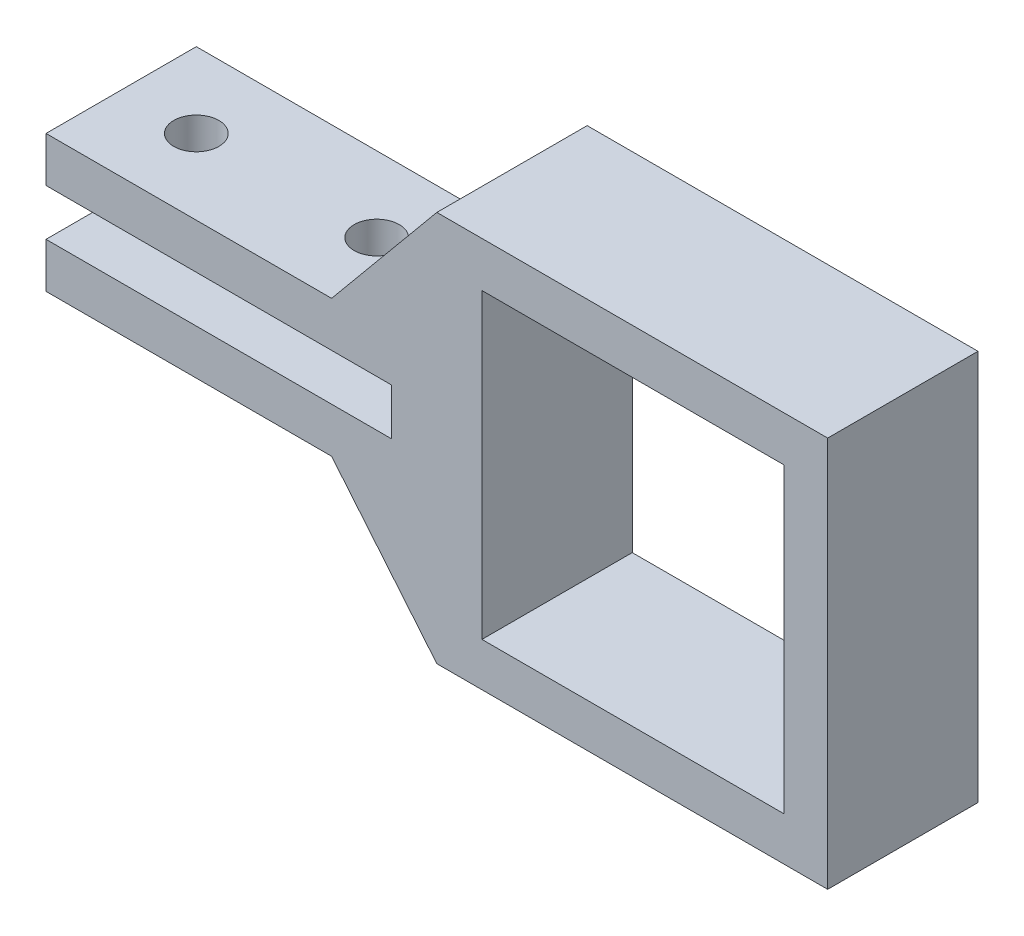
ISO-10303-21;
HEADER;
FILE_DESCRIPTION(('STEP AP214'),'2;1');
FILE_NAME('part.step','',(''),(''),'','','');
FILE_SCHEMA(('AUTOMOTIVE_DESIGN { 1 0 10303 214 1 1 1 1 }'));
ENDSEC;
DATA;
#1=APPLICATION_CONTEXT('core data for automotive mechanical design processes');
#2=APPLICATION_PROTOCOL_DEFINITION('international standard','automotive_design',2000,#1);
#3=PRODUCT_CONTEXT('',#1,'mechanical');
#4=PRODUCT('Part','Part','',(#3));
#5=PRODUCT_RELATED_PRODUCT_CATEGORY('part','',(#4));
#6=PRODUCT_DEFINITION_FORMATION('','',#4);
#7=PRODUCT_DEFINITION_CONTEXT('part definition',#1,'design');
#8=PRODUCT_DEFINITION('design','',#6,#7);
#9=PRODUCT_DEFINITION_SHAPE('','',#8);
#10=(LENGTH_UNIT() NAMED_UNIT(*) SI_UNIT(.MILLI.,.METRE.));
#11=(NAMED_UNIT(*) PLANE_ANGLE_UNIT() SI_UNIT($,.RADIAN.));
#12=(NAMED_UNIT(*) SI_UNIT($,.STERADIAN.) SOLID_ANGLE_UNIT());
#13=UNCERTAINTY_MEASURE_WITH_UNIT(LENGTH_MEASURE(1.E-05),#10,'distance_accuracy_value','');
#14=(GEOMETRIC_REPRESENTATION_CONTEXT(3) GLOBAL_UNCERTAINTY_ASSIGNED_CONTEXT((#13)) GLOBAL_UNIT_ASSIGNED_CONTEXT((#10,
#11,#12)) REPRESENTATION_CONTEXT('',''));
#15=CARTESIAN_POINT('',(0.,0.,0.));
#16=DIRECTION('',(0.,0.,1.));
#17=DIRECTION('',(1.,0.,0.));
#18=AXIS2_PLACEMENT_3D('',#15,#16,#17);
#19=CARTESIAN_POINT('',(0.,-13.,10.));
#20=DIRECTION('',(-0.770085518726512,-0.637940666400661,0.));
#21=DIRECTION('',(0.637940666400661,-0.770085518726512,0.));
#22=AXIS2_PLACEMENT_3D('',#19,#20,#21);
#23=PLANE('',#22);
#24=DIRECTION('',(-0.637940666400661,0.770085518726512,0.));
#25=VECTOR('',#24,1.);
#26=CARTESIAN_POINT('',(0.,-13.,0.));
#27=LINE('',#26,#25);
#28=CARTESIAN_POINT('',(0.,-13.,0.));
#29=VERTEX_POINT('',#28);
#30=CARTESIAN_POINT('',(-7.,-4.55,0.));
#31=VERTEX_POINT('',#30);
#32=EDGE_CURVE('E173',#29,#31,#27,.T.);
#33=ORIENTED_EDGE('',*,*,#32,.F.);
#34=DIRECTION('',(0.,0.,-1.));
#35=VECTOR('',#34,1.);
#36=CARTESIAN_POINT('',(0.,-13.,10.));
#37=LINE('',#36,#35);
#38=CARTESIAN_POINT('',(0.,-13.,10.));
#39=VERTEX_POINT('',#38);
#40=EDGE_CURVE('E240',#39,#29,#37,.T.);
#41=ORIENTED_EDGE('',*,*,#40,.F.);
#42=DIRECTION('',(-0.637940666400661,0.770085518726512,0.));
#43=VECTOR('',#42,1.);
#44=CARTESIAN_POINT('',(0.,-13.,10.));
#45=LINE('',#44,#43);
#46=CARTESIAN_POINT('',(-7.,-4.55,10.));
#47=VERTEX_POINT('',#46);
#48=EDGE_CURVE('E176',#39,#47,#45,.T.);
#49=ORIENTED_EDGE('',*,*,#48,.T.);
#50=DIRECTION('',(0.,0.,-1.));
#51=VECTOR('',#50,1.);
#52=CARTESIAN_POINT('',(-7.,-4.55,10.));
#53=LINE('',#52,#51);
#54=EDGE_CURVE('E207',#47,#31,#53,.T.);
#55=ORIENTED_EDGE('',*,*,#54,.T.);
#56=EDGE_LOOP('',(#33,#41,#49,#55));
#57=FACE_BOUND('',#56,.T.);
#58=ADVANCED_FACE('F35',(#57),#23,.T.);
#59=CARTESIAN_POINT('',(0.,-13.,10.));
#60=DIRECTION('',(0.,1.,0.));
#61=DIRECTION('',(-1.,0.,0.));
#62=AXIS2_PLACEMENT_3D('',#59,#60,#61);
#63=PLANE('',#62);
#64=DIRECTION('',(1.,0.,0.));
#65=VECTOR('',#64,1.);
#66=CARTESIAN_POINT('',(0.,-13.,0.));
#67=LINE('',#66,#65);
#68=CARTESIAN_POINT('',(26.,-13.,0.));
#69=VERTEX_POINT('',#68);
#70=EDGE_CURVE('E180',#29,#69,#67,.T.);
#71=ORIENTED_EDGE('',*,*,#70,.T.);
#72=DIRECTION('',(0.,0.,-1.));
#73=VECTOR('',#72,1.);
#74=CARTESIAN_POINT('',(26.,-13.,10.));
#75=LINE('',#74,#73);
#76=CARTESIAN_POINT('',(26.,-13.,10.));
#77=VERTEX_POINT('',#76);
#78=EDGE_CURVE('E243',#77,#69,#75,.T.);
#79=ORIENTED_EDGE('',*,*,#78,.F.);
#80=DIRECTION('',(1.,0.,0.));
#81=VECTOR('',#80,1.);
#82=CARTESIAN_POINT('',(0.,-13.,10.));
#83=LINE('',#82,#81);
#84=EDGE_CURVE('E205',#39,#77,#83,.T.);
#85=ORIENTED_EDGE('',*,*,#84,.F.);
#86=ORIENTED_EDGE('',*,*,#40,.T.);
#87=EDGE_LOOP('',(#71,#79,#85,#86));
#88=FACE_BOUND('',#87,.T.);
#89=ADVANCED_FACE('F286',(#88),#63,.F.);
#90=CARTESIAN_POINT('',(26.,13.,10.));
#91=DIRECTION('',(1.,0.,0.));
#92=DIRECTION('',(0.,0.,-1.));
#93=AXIS2_PLACEMENT_3D('',#90,#91,#92);
#94=PLANE('',#93);
#95=DIRECTION('',(0.,-1.,0.));
#96=VECTOR('',#95,1.);
#97=CARTESIAN_POINT('',(26.,13.,0.));
#98=LINE('',#97,#96);
#99=CARTESIAN_POINT('',(26.,13.,0.));
#100=VERTEX_POINT('',#99);
#101=EDGE_CURVE('E235',#100,#69,#98,.T.);
#102=ORIENTED_EDGE('',*,*,#101,.F.);
#103=DIRECTION('',(0.,0.,-1.));
#104=VECTOR('',#103,1.);
#105=CARTESIAN_POINT('',(26.,13.,10.));
#106=LINE('',#105,#104);
#107=CARTESIAN_POINT('',(26.,13.,10.));
#108=VERTEX_POINT('',#107);
#109=EDGE_CURVE('E245',#108,#100,#106,.T.);
#110=ORIENTED_EDGE('',*,*,#109,.F.);
#111=DIRECTION('',(0.,-1.,0.));
#112=VECTOR('',#111,1.);
#113=CARTESIAN_POINT('',(26.,13.,10.));
#114=LINE('',#113,#112);
#115=EDGE_CURVE('E202',#108,#77,#114,.T.);
#116=ORIENTED_EDGE('',*,*,#115,.T.);
#117=ORIENTED_EDGE('',*,*,#78,.T.);
#118=EDGE_LOOP('',(#102,#110,#116,#117));
#119=FACE_BOUND('',#118,.T.);
#120=ADVANCED_FACE('F291',(#119),#94,.T.);
#121=CARTESIAN_POINT('',(0.,13.,10.));
#122=DIRECTION('',(0.,1.,0.));
#123=DIRECTION('',(-1.,0.,0.));
#124=AXIS2_PLACEMENT_3D('',#121,#122,#123);
#125=PLANE('',#124);
#126=DIRECTION('',(1.,0.,0.));
#127=VECTOR('',#126,1.);
#128=CARTESIAN_POINT('',(0.,13.,0.));
#129=LINE('',#128,#127);
#130=CARTESIAN_POINT('',(0.,13.,0.));
#131=VERTEX_POINT('',#130);
#132=EDGE_CURVE('E232',#131,#100,#129,.T.);
#133=ORIENTED_EDGE('',*,*,#132,.F.);
#134=DIRECTION('',(0.,0.,-1.));
#135=VECTOR('',#134,1.);
#136=CARTESIAN_POINT('',(0.,13.,10.));
#137=LINE('',#136,#135);
#138=CARTESIAN_POINT('',(0.,13.,10.));
#139=VERTEX_POINT('',#138);
#140=EDGE_CURVE('E247',#139,#131,#137,.T.);
#141=ORIENTED_EDGE('',*,*,#140,.F.);
#142=DIRECTION('',(1.,0.,0.));
#143=VECTOR('',#142,1.);
#144=CARTESIAN_POINT('',(0.,13.,10.));
#145=LINE('',#144,#143);
#146=EDGE_CURVE('E199',#139,#108,#145,.T.);
#147=ORIENTED_EDGE('',*,*,#146,.T.);
#148=ORIENTED_EDGE('',*,*,#109,.T.);
#149=EDGE_LOOP('',(#133,#141,#147,#148));
#150=FACE_BOUND('',#149,.T.);
#151=ADVANCED_FACE('F339',(#150),#125,.T.);
#152=CARTESIAN_POINT('',(0.,13.,10.));
#153=DIRECTION('',(0.770085518726512,-0.637940666400661,0.));
#154=DIRECTION('',(0.637940666400661,0.770085518726512,0.));
#155=AXIS2_PLACEMENT_3D('',#152,#153,#154);
#156=PLANE('',#155);
#157=DIRECTION('',(-0.637940666400661,-0.770085518726512,0.));
#158=VECTOR('',#157,1.);
#159=CARTESIAN_POINT('',(0.,13.,0.));
#160=LINE('',#159,#158);
#161=CARTESIAN_POINT('',(-7.,4.55,0.));
#162=VERTEX_POINT('',#161);
#163=EDGE_CURVE('E229',#131,#162,#160,.T.);
#164=ORIENTED_EDGE('',*,*,#163,.T.);
#165=DIRECTION('',(0.,0.,-1.));
#166=VECTOR('',#165,1.);
#167=CARTESIAN_POINT('',(-7.,4.55,10.));
#168=LINE('',#167,#166);
#169=CARTESIAN_POINT('',(-7.,4.55,10.));
#170=VERTEX_POINT('',#169);
#171=EDGE_CURVE('E249',#170,#162,#168,.T.);
#172=ORIENTED_EDGE('',*,*,#171,.F.);
#173=DIRECTION('',(-0.637940666400661,-0.770085518726512,0.));
#174=VECTOR('',#173,1.);
#175=CARTESIAN_POINT('',(0.,13.,10.));
#176=LINE('',#175,#174);
#177=EDGE_CURVE('E197',#139,#170,#176,.T.);
#178=ORIENTED_EDGE('',*,*,#177,.F.);
#179=ORIENTED_EDGE('',*,*,#140,.T.);
#180=EDGE_LOOP('',(#164,#172,#178,#179));
#181=FACE_BOUND('',#180,.T.);
#182=ADVANCED_FACE('F336',(#181),#156,.F.);
#183=CARTESIAN_POINT('',(-26.,4.55,10.));
#184=DIRECTION('',(0.,1.,0.));
#185=DIRECTION('',(0.,0.,1.));
#186=AXIS2_PLACEMENT_3D('',#183,#184,#185);
#187=PLANE('',#186);
#188=CARTESIAN_POINT('',(-21.,4.55,5.));
#189=DIRECTION('',(0.,1.,0.));
#190=DIRECTION('',(-1.,0.,0.));
#191=AXIS2_PLACEMENT_3D('',#188,#189,#190);
#192=CIRCLE('',#191,1.5);
#193=CARTESIAN_POINT('',(-22.5,4.55,5.));
#194=VERTEX_POINT('',#193);
#195=EDGE_CURVE('E374',#194,#194,#192,.T.);
#196=ORIENTED_EDGE('',*,*,#195,.F.);
#197=EDGE_LOOP('',(#196));
#198=FACE_BOUND('',#197,.T.);
#199=CARTESIAN_POINT('',(-9.,4.55,5.));
#200=DIRECTION('',(0.,1.,0.));
#201=DIRECTION('',(-1.,0.,0.));
#202=AXIS2_PLACEMENT_3D('',#199,#200,#201);
#203=CIRCLE('',#202,1.5);
#204=CARTESIAN_POINT('',(-10.5,4.55,5.));
#205=VERTEX_POINT('',#204);
#206=EDGE_CURVE('E375',#205,#205,#203,.T.);
#207=ORIENTED_EDGE('',*,*,#206,.F.);
#208=EDGE_LOOP('',(#207));
#209=FACE_BOUND('',#208,.T.);
#210=DIRECTION('',(1.,0.,0.));
#211=VECTOR('',#210,1.);
#212=CARTESIAN_POINT('',(-26.,4.55,0.));
#213=LINE('',#212,#211);
#214=CARTESIAN_POINT('',(-26.,4.55,0.));
#215=VERTEX_POINT('',#214);
#216=EDGE_CURVE('E226',#215,#162,#213,.T.);
#217=ORIENTED_EDGE('',*,*,#216,.F.);
#218=DIRECTION('',(0.,0.,-1.));
#219=VECTOR('',#218,1.);
#220=CARTESIAN_POINT('',(-26.,4.55,10.));
#221=LINE('',#220,#219);
#222=CARTESIAN_POINT('',(-26.,4.55,10.));
#223=VERTEX_POINT('',#222);
#224=EDGE_CURVE('E251',#223,#215,#221,.T.);
#225=ORIENTED_EDGE('',*,*,#224,.F.);
#226=DIRECTION('',(1.,0.,0.));
#227=VECTOR('',#226,1.);
#228=CARTESIAN_POINT('',(-26.,4.55,10.));
#229=LINE('',#228,#227);
#230=EDGE_CURVE('E194',#223,#170,#229,.T.);
#231=ORIENTED_EDGE('',*,*,#230,.T.);
#232=ORIENTED_EDGE('',*,*,#171,.T.);
#233=EDGE_LOOP('',(#217,#225,#231,#232));
#234=FACE_BOUND('',#233,.T.);
#235=ADVANCED_FACE('F330',(#198,#209,#234),#187,.T.);
#236=CARTESIAN_POINT('',(-26.,4.55,10.));
#237=DIRECTION('',(1.,0.,0.));
#238=DIRECTION('',(0.,0.,-1.));
#239=AXIS2_PLACEMENT_3D('',#236,#237,#238);
#240=PLANE('',#239);
#241=DIRECTION('',(0.,-1.,0.));
#242=VECTOR('',#241,1.);
#243=CARTESIAN_POINT('',(-26.,4.55,0.));
#244=LINE('',#243,#242);
#245=CARTESIAN_POINT('',(-26.,1.55,0.));
#246=VERTEX_POINT('',#245);
#247=EDGE_CURVE('E224',#215,#246,#244,.T.);
#248=ORIENTED_EDGE('',*,*,#247,.T.);
#249=DIRECTION('',(0.,0.,-1.));
#250=VECTOR('',#249,1.);
#251=CARTESIAN_POINT('',(-26.,1.55,10.));
#252=LINE('',#251,#250);
#253=CARTESIAN_POINT('',(-26.,1.55,10.));
#254=VERTEX_POINT('',#253);
#255=EDGE_CURVE('E253',#254,#246,#252,.T.);
#256=ORIENTED_EDGE('',*,*,#255,.F.);
#257=DIRECTION('',(0.,-1.,0.));
#258=VECTOR('',#257,1.);
#259=CARTESIAN_POINT('',(-26.,4.55,10.));
#260=LINE('',#259,#258);
#261=EDGE_CURVE('E192',#223,#254,#260,.T.);
#262=ORIENTED_EDGE('',*,*,#261,.F.);
#263=ORIENTED_EDGE('',*,*,#224,.T.);
#264=EDGE_LOOP('',(#248,#256,#262,#263));
#265=FACE_BOUND('',#264,.T.);
#266=ADVANCED_FACE('F342',(#265),#240,.F.);
#267=CARTESIAN_POINT('',(-26.,1.55,10.));
#268=DIRECTION('',(0.,1.,0.));
#269=DIRECTION('',(0.,0.,1.));
#270=AXIS2_PLACEMENT_3D('',#267,#268,#269);
#271=PLANE('',#270);
#272=CARTESIAN_POINT('',(-21.,1.55,5.));
#273=DIRECTION('',(0.,1.,0.));
#274=DIRECTION('',(0.,0.,1.));
#275=AXIS2_PLACEMENT_3D('',#272,#273,#274);
#276=CIRCLE('',#275,1.5);
#277=CARTESIAN_POINT('',(-21.,1.55,6.5));
#278=VERTEX_POINT('',#277);
#279=EDGE_CURVE('E392',#278,#278,#276,.T.);
#280=ORIENTED_EDGE('',*,*,#279,.T.);
#281=EDGE_LOOP('',(#280));
#282=FACE_BOUND('',#281,.T.);
#283=CARTESIAN_POINT('',(-9.,1.55,5.));
#284=DIRECTION('',(0.,1.,0.));
#285=DIRECTION('',(0.,0.,1.));
#286=AXIS2_PLACEMENT_3D('',#283,#284,#285);
#287=CIRCLE('',#286,1.5);
#288=CARTESIAN_POINT('',(-9.,1.55,6.5));
#289=VERTEX_POINT('',#288);
#290=EDGE_CURVE('E386',#289,#289,#287,.T.);
#291=ORIENTED_EDGE('',*,*,#290,.T.);
#292=EDGE_LOOP('',(#291));
#293=FACE_BOUND('',#292,.T.);
#294=DIRECTION('',(1.,0.,0.));
#295=VECTOR('',#294,1.);
#296=CARTESIAN_POINT('',(-26.,1.55,0.));
#297=LINE('',#296,#295);
#298=CARTESIAN_POINT('',(-3.,1.55,0.));
#299=VERTEX_POINT('',#298);
#300=EDGE_CURVE('E222',#246,#299,#297,.T.);
#301=ORIENTED_EDGE('',*,*,#300,.T.);
#302=DIRECTION('',(0.,0.,-1.));
#303=VECTOR('',#302,1.);
#304=CARTESIAN_POINT('',(-3.,1.55,10.));
#305=LINE('',#304,#303);
#306=CARTESIAN_POINT('',(-3.,1.55,10.));
#307=VERTEX_POINT('',#306);
#308=EDGE_CURVE('E256',#307,#299,#305,.T.);
#309=ORIENTED_EDGE('',*,*,#308,.F.);
#310=DIRECTION('',(1.,0.,0.));
#311=VECTOR('',#310,1.);
#312=CARTESIAN_POINT('',(-26.,1.55,10.));
#313=LINE('',#312,#311);
#314=EDGE_CURVE('E190',#254,#307,#313,.T.);
#315=ORIENTED_EDGE('',*,*,#314,.F.);
#316=ORIENTED_EDGE('',*,*,#255,.T.);
#317=EDGE_LOOP('',(#301,#309,#315,#316));
#318=FACE_BOUND('',#317,.T.);
#319=ADVANCED_FACE('F323',(#282,#293,#318),#271,.F.);
#320=CARTESIAN_POINT('',(-3.,1.55,10.));
#321=DIRECTION('',(1.,0.,0.));
#322=DIRECTION('',(0.,0.,-1.));
#323=AXIS2_PLACEMENT_3D('',#320,#321,#322);
#324=PLANE('',#323);
#325=DIRECTION('',(0.,-1.,0.));
#326=VECTOR('',#325,1.);
#327=CARTESIAN_POINT('',(-3.,1.55,0.));
#328=LINE('',#327,#326);
#329=CARTESIAN_POINT('',(-3.,-1.55,0.));
#330=VERTEX_POINT('',#329);
#331=EDGE_CURVE('E219',#299,#330,#328,.T.);
#332=ORIENTED_EDGE('',*,*,#331,.T.);
#333=DIRECTION('',(0.,0.,-1.));
#334=VECTOR('',#333,1.);
#335=CARTESIAN_POINT('',(-3.,-1.55,10.));
#336=LINE('',#335,#334);
#337=CARTESIAN_POINT('',(-3.,-1.55,10.));
#338=VERTEX_POINT('',#337);
#339=EDGE_CURVE('E259',#338,#330,#336,.T.);
#340=ORIENTED_EDGE('',*,*,#339,.F.);
#341=DIRECTION('',(0.,-1.,0.));
#342=VECTOR('',#341,1.);
#343=CARTESIAN_POINT('',(-3.,1.55,10.));
#344=LINE('',#343,#342);
#345=EDGE_CURVE('E188',#307,#338,#344,.T.);
#346=ORIENTED_EDGE('',*,*,#345,.F.);
#347=ORIENTED_EDGE('',*,*,#308,.T.);
#348=EDGE_LOOP('',(#332,#340,#346,#347));
#349=FACE_BOUND('',#348,.T.);
#350=ADVANCED_FACE('F319',(#349),#324,.F.);
#351=CARTESIAN_POINT('',(-26.,-1.55,10.));
#352=DIRECTION('',(0.,1.,0.));
#353=DIRECTION('',(0.,0.,1.));
#354=AXIS2_PLACEMENT_3D('',#351,#352,#353);
#355=PLANE('',#354);
#356=CARTESIAN_POINT('',(-21.,-1.55,5.));
#357=DIRECTION('',(0.,1.,0.));
#358=DIRECTION('',(0.,0.,1.));
#359=AXIS2_PLACEMENT_3D('',#356,#357,#358);
#360=CIRCLE('',#359,1.5);
#361=CARTESIAN_POINT('',(-21.,-1.55,6.5));
#362=VERTEX_POINT('',#361);
#363=EDGE_CURVE('E389',#362,#362,#360,.T.);
#364=ORIENTED_EDGE('',*,*,#363,.F.);
#365=EDGE_LOOP('',(#364));
#366=FACE_BOUND('',#365,.T.);
#367=CARTESIAN_POINT('',(-9.,-1.55,5.));
#368=DIRECTION('',(0.,1.,0.));
#369=DIRECTION('',(0.,0.,1.));
#370=AXIS2_PLACEMENT_3D('',#367,#368,#369);
#371=CIRCLE('',#370,1.5);
#372=CARTESIAN_POINT('',(-9.,-1.55,6.5));
#373=VERTEX_POINT('',#372);
#374=EDGE_CURVE('E383',#373,#373,#371,.T.);
#375=ORIENTED_EDGE('',*,*,#374,.F.);
#376=EDGE_LOOP('',(#375));
#377=FACE_BOUND('',#376,.T.);
#378=DIRECTION('',(1.,0.,0.));
#379=VECTOR('',#378,1.);
#380=CARTESIAN_POINT('',(-26.,-1.55,0.));
#381=LINE('',#380,#379);
#382=CARTESIAN_POINT('',(-26.,-1.55,0.));
#383=VERTEX_POINT('',#382);
#384=EDGE_CURVE('E216',#383,#330,#381,.T.);
#385=ORIENTED_EDGE('',*,*,#384,.F.);
#386=DIRECTION('',(0.,0.,-1.));
#387=VECTOR('',#386,1.);
#388=CARTESIAN_POINT('',(-26.,-1.55,10.));
#389=LINE('',#388,#387);
#390=CARTESIAN_POINT('',(-26.,-1.55,10.));
#391=VERTEX_POINT('',#390);
#392=EDGE_CURVE('E261',#391,#383,#389,.T.);
#393=ORIENTED_EDGE('',*,*,#392,.F.);
#394=DIRECTION('',(1.,0.,0.));
#395=VECTOR('',#394,1.);
#396=CARTESIAN_POINT('',(-26.,-1.55,10.));
#397=LINE('',#396,#395);
#398=EDGE_CURVE('E185',#391,#338,#397,.T.);
#399=ORIENTED_EDGE('',*,*,#398,.T.);
#400=ORIENTED_EDGE('',*,*,#339,.T.);
#401=EDGE_LOOP('',(#385,#393,#399,#400));
#402=FACE_BOUND('',#401,.T.);
#403=ADVANCED_FACE('F315',(#366,#377,#402),#355,.T.);
#404=CARTESIAN_POINT('',(-26.,-4.55,10.));
#405=DIRECTION('',(-1.,0.,0.));
#406=DIRECTION('',(0.,0.,1.));
#407=AXIS2_PLACEMENT_3D('',#404,#405,#406);
#408=PLANE('',#407);
#409=DIRECTION('',(0.,1.,0.));
#410=VECTOR('',#409,1.);
#411=CARTESIAN_POINT('',(-26.,-4.55,0.));
#412=LINE('',#411,#410);
#413=CARTESIAN_POINT('',(-26.,-4.55,0.));
#414=VERTEX_POINT('',#413);
#415=EDGE_CURVE('E213',#414,#383,#412,.T.);
#416=ORIENTED_EDGE('',*,*,#415,.F.);
#417=DIRECTION('',(0.,0.,-1.));
#418=VECTOR('',#417,1.);
#419=CARTESIAN_POINT('',(-26.,-4.55,10.));
#420=LINE('',#419,#418);
#421=CARTESIAN_POINT('',(-26.,-4.55,10.));
#422=VERTEX_POINT('',#421);
#423=EDGE_CURVE('E263',#422,#414,#420,.T.);
#424=ORIENTED_EDGE('',*,*,#423,.F.);
#425=DIRECTION('',(0.,1.,0.));
#426=VECTOR('',#425,1.);
#427=CARTESIAN_POINT('',(-26.,-4.55,10.));
#428=LINE('',#427,#426);
#429=EDGE_CURVE('E182',#422,#391,#428,.T.);
#430=ORIENTED_EDGE('',*,*,#429,.T.);
#431=ORIENTED_EDGE('',*,*,#392,.T.);
#432=EDGE_LOOP('',(#416,#424,#430,#431));
#433=FACE_BOUND('',#432,.T.);
#434=ADVANCED_FACE('F310',(#433),#408,.T.);
#435=CARTESIAN_POINT('',(-26.,-4.55,10.));
#436=DIRECTION('',(0.,1.,0.));
#437=DIRECTION('',(0.,0.,1.));
#438=AXIS2_PLACEMENT_3D('',#435,#436,#437);
#439=PLANE('',#438);
#440=CARTESIAN_POINT('',(-21.,-4.55,5.));
#441=DIRECTION('',(0.,1.,0.));
#442=DIRECTION('',(0.,0.,1.));
#443=AXIS2_PLACEMENT_3D('',#440,#441,#442);
#444=CIRCLE('',#443,1.5);
#445=CARTESIAN_POINT('',(-21.,-4.55,6.5));
#446=VERTEX_POINT('',#445);
#447=EDGE_CURVE('E369',#446,#446,#444,.F.);
#448=ORIENTED_EDGE('',*,*,#447,.F.);
#449=EDGE_LOOP('',(#448));
#450=FACE_BOUND('',#449,.T.);
#451=CARTESIAN_POINT('',(-9.,-4.55,5.));
#452=DIRECTION('',(0.,1.,0.));
#453=DIRECTION('',(0.,0.,1.));
#454=AXIS2_PLACEMENT_3D('',#451,#452,#453);
#455=CIRCLE('',#454,1.5);
#456=CARTESIAN_POINT('',(-9.,-4.55,6.5));
#457=VERTEX_POINT('',#456);
#458=EDGE_CURVE('E372',#457,#457,#455,.F.);
#459=ORIENTED_EDGE('',*,*,#458,.F.);
#460=EDGE_LOOP('',(#459));
#461=FACE_BOUND('',#460,.T.);
#462=DIRECTION('',(1.,0.,0.));
#463=VECTOR('',#462,1.);
#464=CARTESIAN_POINT('',(-26.,-4.55,0.));
#465=LINE('',#464,#463);
#466=EDGE_CURVE('E210',#414,#31,#465,.T.);
#467=ORIENTED_EDGE('',*,*,#466,.T.);
#468=ORIENTED_EDGE('',*,*,#54,.F.);
#469=DIRECTION('',(1.,0.,0.));
#470=VECTOR('',#469,1.);
#471=CARTESIAN_POINT('',(-26.,-4.55,10.));
#472=LINE('',#471,#470);
#473=EDGE_CURVE('E179',#422,#47,#472,.T.);
#474=ORIENTED_EDGE('',*,*,#473,.F.);
#475=ORIENTED_EDGE('',*,*,#423,.T.);
#476=EDGE_LOOP('',(#467,#468,#474,#475));
#477=FACE_BOUND('',#476,.T.);
#478=ADVANCED_FACE('F308',(#450,#461,#477),#439,.F.);
#479=CARTESIAN_POINT('',(0.,0.,10.));
#480=DIRECTION('',(0.,0.,1.));
#481=DIRECTION('',(1.,0.,0.));
#482=AXIS2_PLACEMENT_3D('',#479,#480,#481);
#483=PLANE('',#482);
#484=DIRECTION('',(-1.,0.,0.));
#485=VECTOR('',#484,1.);
#486=CARTESIAN_POINT('',(23.1,10.,10.));
#487=LINE('',#486,#485);
#488=CARTESIAN_POINT('',(23.1,10.,10.));
#489=VERTEX_POINT('',#488);
#490=CARTESIAN_POINT('',(3.,10.,10.));
#491=VERTEX_POINT('',#490);
#492=EDGE_CURVE('E49',#489,#491,#487,.T.);
#493=ORIENTED_EDGE('',*,*,#492,.F.);
#494=DIRECTION('',(0.,1.,0.));
#495=VECTOR('',#494,1.);
#496=CARTESIAN_POINT('',(23.1,10.,10.));
#497=LINE('',#496,#495);
#498=CARTESIAN_POINT('',(23.1,-10.1,10.));
#499=VERTEX_POINT('',#498);
#500=EDGE_CURVE('E166',#499,#489,#497,.T.);
#501=ORIENTED_EDGE('',*,*,#500,.F.);
#502=DIRECTION('',(1.,0.,0.));
#503=VECTOR('',#502,1.);
#504=CARTESIAN_POINT('',(3.,-10.1,10.));
#505=LINE('',#504,#503);
#506=CARTESIAN_POINT('',(3.,-10.1,10.));
#507=VERTEX_POINT('',#506);
#508=EDGE_CURVE('E150',#507,#499,#505,.T.);
#509=ORIENTED_EDGE('',*,*,#508,.F.);
#510=DIRECTION('',(0.,-1.,0.));
#511=VECTOR('',#510,1.);
#512=CARTESIAN_POINT('',(3.,10.,10.));
#513=LINE('',#512,#511);
#514=EDGE_CURVE('E159',#491,#507,#513,.T.);
#515=ORIENTED_EDGE('',*,*,#514,.F.);
#516=EDGE_LOOP('',(#493,#501,#509,#515));
#517=FACE_BOUND('',#516,.T.);
#518=ORIENTED_EDGE('',*,*,#48,.F.);
#519=ORIENTED_EDGE('',*,*,#84,.T.);
#520=ORIENTED_EDGE('',*,*,#115,.F.);
#521=ORIENTED_EDGE('',*,*,#146,.F.);
#522=ORIENTED_EDGE('',*,*,#177,.T.);
#523=ORIENTED_EDGE('',*,*,#230,.F.);
#524=ORIENTED_EDGE('',*,*,#261,.T.);
#525=ORIENTED_EDGE('',*,*,#314,.T.);
#526=ORIENTED_EDGE('',*,*,#345,.T.);
#527=ORIENTED_EDGE('',*,*,#398,.F.);
#528=ORIENTED_EDGE('',*,*,#429,.F.);
#529=ORIENTED_EDGE('',*,*,#473,.T.);
#530=EDGE_LOOP('',(#518,#519,#520,#521,#522,#523,#524,#525,#526,#527,#528,#529));
#531=FACE_BOUND('',#530,.T.);
#532=ADVANCED_FACE('F163',(#517,#531),#483,.T.);
#533=CARTESIAN_POINT('',(0.,0.,0.));
#534=DIRECTION('',(0.,0.,1.));
#535=DIRECTION('',(1.,0.,0.));
#536=AXIS2_PLACEMENT_3D('',#533,#534,#535);
#537=PLANE('',#536);
#538=DIRECTION('',(0.,1.,0.));
#539=VECTOR('',#538,1.);
#540=CARTESIAN_POINT('',(23.1,0.,0.));
#541=LINE('',#540,#539);
#542=CARTESIAN_POINT('',(23.1,-10.1,0.));
#543=VERTEX_POINT('',#542);
#544=CARTESIAN_POINT('',(23.1,10.,0.));
#545=VERTEX_POINT('',#544);
#546=EDGE_CURVE('E42',#543,#545,#541,.T.);
#547=ORIENTED_EDGE('',*,*,#546,.T.);
#548=DIRECTION('',(-1.,0.,0.));
#549=VECTOR('',#548,1.);
#550=CARTESIAN_POINT('',(0.,10.,0.));
#551=LINE('',#550,#549);
#552=CARTESIAN_POINT('',(3.,10.,0.));
#553=VERTEX_POINT('',#552);
#554=EDGE_CURVE('E11',#545,#553,#551,.T.);
#555=ORIENTED_EDGE('',*,*,#554,.T.);
#556=DIRECTION('',(0.,-1.,0.));
#557=VECTOR('',#556,1.);
#558=CARTESIAN_POINT('',(3.,0.,0.));
#559=LINE('',#558,#557);
#560=CARTESIAN_POINT('',(3.,-10.1,0.));
#561=VERTEX_POINT('',#560);
#562=EDGE_CURVE('E242',#553,#561,#559,.T.);
#563=ORIENTED_EDGE('',*,*,#562,.T.);
#564=DIRECTION('',(1.,0.,0.));
#565=VECTOR('',#564,1.);
#566=CARTESIAN_POINT('',(0.,-10.1,0.));
#567=LINE('',#566,#565);
#568=EDGE_CURVE('E153',#561,#543,#567,.T.);
#569=ORIENTED_EDGE('',*,*,#568,.T.);
#570=EDGE_LOOP('',(#547,#555,#563,#569));
#571=FACE_BOUND('',#570,.T.);
#572=ORIENTED_EDGE('',*,*,#32,.T.);
#573=ORIENTED_EDGE('',*,*,#466,.F.);
#574=ORIENTED_EDGE('',*,*,#415,.T.);
#575=ORIENTED_EDGE('',*,*,#384,.T.);
#576=ORIENTED_EDGE('',*,*,#331,.F.);
#577=ORIENTED_EDGE('',*,*,#300,.F.);
#578=ORIENTED_EDGE('',*,*,#247,.F.);
#579=ORIENTED_EDGE('',*,*,#216,.T.);
#580=ORIENTED_EDGE('',*,*,#163,.F.);
#581=ORIENTED_EDGE('',*,*,#132,.T.);
#582=ORIENTED_EDGE('',*,*,#101,.T.);
#583=ORIENTED_EDGE('',*,*,#70,.F.);
#584=EDGE_LOOP('',(#572,#573,#574,#575,#576,#577,#578,#579,#580,#581,#582,#583));
#585=FACE_BOUND('',#584,.T.);
#586=ADVANCED_FACE('F269',(#571,#585),#537,.F.);
#587=CARTESIAN_POINT('',(23.1,10.,-20.));
#588=DIRECTION('',(0.,1.,0.));
#589=DIRECTION('',(0.,0.,1.));
#590=AXIS2_PLACEMENT_3D('',#587,#588,#589);
#591=PLANE('',#590);
#592=DIRECTION('',(0.,0.,1.));
#593=VECTOR('',#592,1.);
#594=CARTESIAN_POINT('',(23.1,10.,-20.));
#595=LINE('',#594,#593);
#596=EDGE_CURVE('E171',#545,#489,#595,.T.);
#597=ORIENTED_EDGE('',*,*,#596,.T.);
#598=ORIENTED_EDGE('',*,*,#492,.T.);
#599=DIRECTION('',(0.,0.,1.));
#600=VECTOR('',#599,1.);
#601=CARTESIAN_POINT('',(3.,10.,-20.));
#602=LINE('',#601,#600);
#603=EDGE_CURVE('E156',#553,#491,#602,.T.);
#604=ORIENTED_EDGE('',*,*,#603,.F.);
#605=ORIENTED_EDGE('',*,*,#554,.F.);
#606=EDGE_LOOP('',(#597,#598,#604,#605));
#607=FACE_BOUND('',#606,.T.);
#608=ADVANCED_FACE('F274',(#607),#591,.F.);
#609=CARTESIAN_POINT('',(23.1,10.,-20.));
#610=DIRECTION('',(1.,0.,0.));
#611=DIRECTION('',(0.,0.,-1.));
#612=AXIS2_PLACEMENT_3D('',#609,#610,#611);
#613=PLANE('',#612);
#614=DIRECTION('',(0.,0.,1.));
#615=VECTOR('',#614,1.);
#616=CARTESIAN_POINT('',(23.1,-10.1,-20.));
#617=LINE('',#616,#615);
#618=EDGE_CURVE('E155',#543,#499,#617,.T.);
#619=ORIENTED_EDGE('',*,*,#618,.T.);
#620=ORIENTED_EDGE('',*,*,#500,.T.);
#621=ORIENTED_EDGE('',*,*,#596,.F.);
#622=ORIENTED_EDGE('',*,*,#546,.F.);
#623=EDGE_LOOP('',(#619,#620,#621,#622));
#624=FACE_BOUND('',#623,.T.);
#625=ADVANCED_FACE('F273',(#624),#613,.F.);
#626=CARTESIAN_POINT('',(3.,-10.1,-20.));
#627=DIRECTION('',(0.,-1.,0.));
#628=DIRECTION('',(1.,0.,0.));
#629=AXIS2_PLACEMENT_3D('',#626,#627,#628);
#630=PLANE('',#629);
#631=DIRECTION('',(0.,0.,1.));
#632=VECTOR('',#631,1.);
#633=CARTESIAN_POINT('',(3.,-10.1,-20.));
#634=LINE('',#633,#632);
#635=EDGE_CURVE('E57',#561,#507,#634,.T.);
#636=ORIENTED_EDGE('',*,*,#635,.T.);
#637=ORIENTED_EDGE('',*,*,#508,.T.);
#638=ORIENTED_EDGE('',*,*,#618,.F.);
#639=ORIENTED_EDGE('',*,*,#568,.F.);
#640=EDGE_LOOP('',(#636,#637,#638,#639));
#641=FACE_BOUND('',#640,.T.);
#642=ADVANCED_FACE('F147',(#641),#630,.F.);
#643=CARTESIAN_POINT('',(3.,10.,-20.));
#644=DIRECTION('',(-1.,0.,0.));
#645=DIRECTION('',(0.,-1.,0.));
#646=AXIS2_PLACEMENT_3D('',#643,#644,#645);
#647=PLANE('',#646);
#648=ORIENTED_EDGE('',*,*,#603,.T.);
#649=ORIENTED_EDGE('',*,*,#514,.T.);
#650=ORIENTED_EDGE('',*,*,#635,.F.);
#651=ORIENTED_EDGE('',*,*,#562,.F.);
#652=EDGE_LOOP('',(#648,#649,#650,#651));
#653=FACE_BOUND('',#652,.T.);
#654=ADVANCED_FACE('F160',(#653),#647,.F.);
#655=CARTESIAN_POINT('',(-9.,-8.7926406871193,5.));
#656=DIRECTION('',(0.,1.,0.));
#657=DIRECTION('',(-1.,0.,0.));
#658=AXIS2_PLACEMENT_3D('',#655,#656,#657);
#659=CYLINDRICAL_SURFACE('',#658,1.5);
#660=ORIENTED_EDGE('',*,*,#374,.T.);
#661=EDGE_LOOP('',(#660));
#662=FACE_BOUND('',#661,.T.);
#663=ORIENTED_EDGE('',*,*,#458,.T.);
#664=EDGE_LOOP('',(#663));
#665=FACE_BOUND('',#664,.T.);
#666=ADVANCED_FACE('F408',(#662,#665),#659,.F.);
#667=CARTESIAN_POINT('',(-21.,-8.7926406871193,5.));
#668=DIRECTION('',(0.,1.,0.));
#669=DIRECTION('',(-1.,0.,0.));
#670=AXIS2_PLACEMENT_3D('',#667,#668,#669);
#671=CYLINDRICAL_SURFACE('',#670,1.5);
#672=ORIENTED_EDGE('',*,*,#363,.T.);
#673=EDGE_LOOP('',(#672));
#674=FACE_BOUND('',#673,.T.);
#675=ORIENTED_EDGE('',*,*,#447,.T.);
#676=EDGE_LOOP('',(#675));
#677=FACE_BOUND('',#676,.T.);
#678=ADVANCED_FACE('F402',(#674,#677),#671,.F.);
#679=ORIENTED_EDGE('',*,*,#206,.T.);
#680=EDGE_LOOP('',(#679));
#681=FACE_BOUND('',#680,.T.);
#682=ORIENTED_EDGE('',*,*,#290,.F.);
#683=EDGE_LOOP('',(#682));
#684=FACE_BOUND('',#683,.T.);
#685=ADVANCED_FACE('F399',(#681,#684),#659,.F.);
#686=ORIENTED_EDGE('',*,*,#195,.T.);
#687=EDGE_LOOP('',(#686));
#688=FACE_BOUND('',#687,.T.);
#689=ORIENTED_EDGE('',*,*,#279,.F.);
#690=EDGE_LOOP('',(#689));
#691=FACE_BOUND('',#690,.T.);
#692=ADVANCED_FACE('F397',(#688,#691),#671,.F.);
#693=CLOSED_SHELL('',(#58,#89,#120,#151,#182,#235,#266,#319,#350,#403,#434,#478,#532,#586,#608,
#625,#642,#654,#666,#678,#685,#692));
#694=MANIFOLD_SOLID_BREP('B2',#693);
#695=ADVANCED_BREP_SHAPE_REPRESENTATION('',(#18,#694),#14);
#696=SHAPE_DEFINITION_REPRESENTATION(#9,#695);
ENDSEC;
END-ISO-10303-21;
